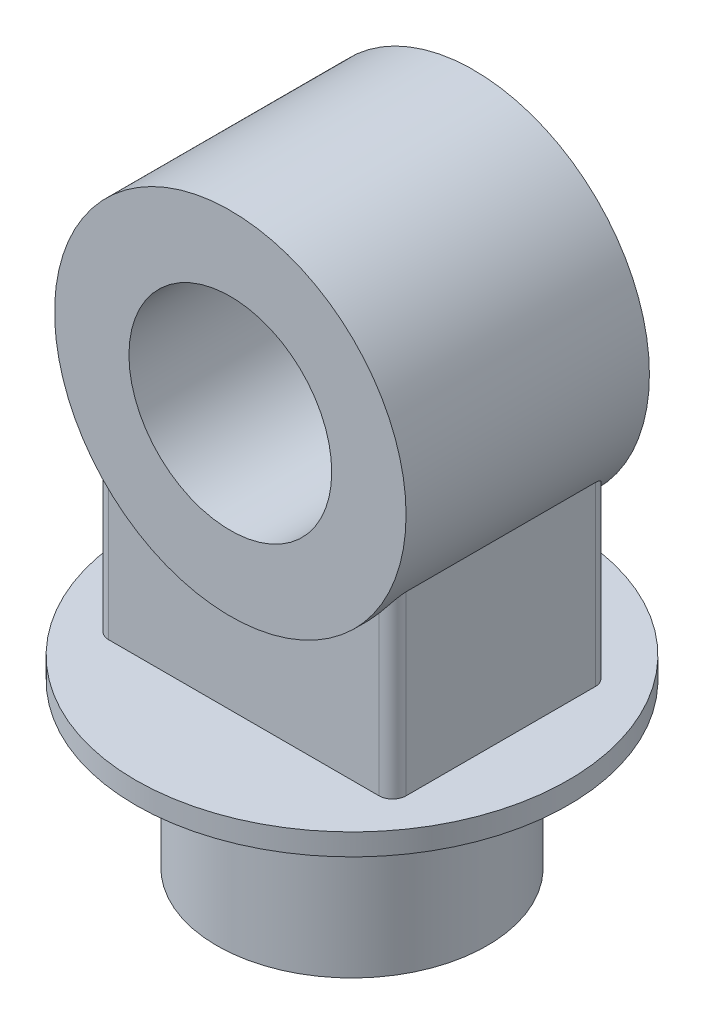
ISO-10303-21;
HEADER;
FILE_DESCRIPTION(('STEP AP214'),'2;1');
FILE_NAME('part.step','',(''),(''),'','','');
FILE_SCHEMA(('AUTOMOTIVE_DESIGN { 1 0 10303 214 1 1 1 1 }'));
ENDSEC;
DATA;
#1=APPLICATION_CONTEXT('core data for automotive mechanical design processes');
#2=APPLICATION_PROTOCOL_DEFINITION('international standard','automotive_design',2000,#1);
#3=PRODUCT_CONTEXT('',#1,'mechanical');
#4=PRODUCT('Part','Part','',(#3));
#5=PRODUCT_RELATED_PRODUCT_CATEGORY('part','',(#4));
#6=PRODUCT_DEFINITION_FORMATION('','',#4);
#7=PRODUCT_DEFINITION_CONTEXT('part definition',#1,'design');
#8=PRODUCT_DEFINITION('design','',#6,#7);
#9=PRODUCT_DEFINITION_SHAPE('','',#8);
#10=(LENGTH_UNIT() NAMED_UNIT(*) SI_UNIT(.MILLI.,.METRE.));
#11=(NAMED_UNIT(*) PLANE_ANGLE_UNIT() SI_UNIT($,.RADIAN.));
#12=(NAMED_UNIT(*) SI_UNIT($,.STERADIAN.) SOLID_ANGLE_UNIT());
#13=UNCERTAINTY_MEASURE_WITH_UNIT(LENGTH_MEASURE(1.E-05),#10,'distance_accuracy_value','');
#14=(GEOMETRIC_REPRESENTATION_CONTEXT(3) GLOBAL_UNCERTAINTY_ASSIGNED_CONTEXT((#13)) GLOBAL_UNIT_ASSIGNED_CONTEXT((#10,
#11,#12)) REPRESENTATION_CONTEXT('',''));
#15=CARTESIAN_POINT('',(0.,0.,0.));
#16=DIRECTION('',(0.,0.,1.));
#17=DIRECTION('',(1.,0.,0.));
#18=AXIS2_PLACEMENT_3D('',#15,#16,#17);
#19=CARTESIAN_POINT('',(0.,120.,0.));
#20=DIRECTION('',(0.,-1.,0.));
#21=DIRECTION('',(0.,0.,-1.));
#22=AXIS2_PLACEMENT_3D('',#19,#20,#21);
#23=CYLINDRICAL_SURFACE('',#22,100.);
#24=CARTESIAN_POINT('',(0.,120.,0.));
#25=DIRECTION('',(0.,1.,0.));
#26=DIRECTION('',(0.,0.,1.));
#27=AXIS2_PLACEMENT_3D('',#24,#25,#26);
#28=CIRCLE('',#27,100.);
#29=CARTESIAN_POINT('',(0.,120.,100.));
#30=VERTEX_POINT('',#29);
#31=EDGE_CURVE('E146',#30,#30,#28,.T.);
#32=ORIENTED_EDGE('',*,*,#31,.F.);
#33=EDGE_LOOP('',(#32));
#34=FACE_BOUND('',#33,.T.);
#35=CARTESIAN_POINT('',(0.,0.,0.));
#36=DIRECTION('',(0.,1.,0.));
#37=DIRECTION('',(0.,0.,1.));
#38=AXIS2_PLACEMENT_3D('',#35,#36,#37);
#39=CIRCLE('',#38,100.);
#40=CARTESIAN_POINT('',(0.,0.,100.));
#41=VERTEX_POINT('',#40);
#42=EDGE_CURVE('E229',#41,#41,#39,.T.);
#43=ORIENTED_EDGE('',*,*,#42,.T.);
#44=EDGE_LOOP('',(#43));
#45=FACE_BOUND('',#44,.T.);
#46=ADVANCED_FACE('F39',(#34,#45),#23,.T.);
#47=CARTESIAN_POINT('',(0.,0.,0.));
#48=DIRECTION('',(0.,1.,0.));
#49=DIRECTION('',(0.,0.,1.));
#50=AXIS2_PLACEMENT_3D('',#47,#48,#49);
#51=PLANE('',#50);
#52=ORIENTED_EDGE('',*,*,#42,.F.);
#53=EDGE_LOOP('',(#52));
#54=FACE_BOUND('',#53,.T.);
#55=ADVANCED_FACE('F242',(#54),#51,.F.);
#56=CARTESIAN_POINT('',(0.,136.,0.));
#57=DIRECTION('',(0.,-1.,0.));
#58=DIRECTION('',(0.,0.,-1.));
#59=AXIS2_PLACEMENT_3D('',#56,#57,#58);
#60=CYLINDRICAL_SURFACE('',#59,160.);
#61=CARTESIAN_POINT('',(0.,136.,0.));
#62=DIRECTION('',(0.,1.,0.));
#63=DIRECTION('',(0.,0.,1.));
#64=AXIS2_PLACEMENT_3D('',#61,#62,#63);
#65=CIRCLE('',#64,160.);
#66=CARTESIAN_POINT('',(0.,136.,160.));
#67=VERTEX_POINT('',#66);
#68=EDGE_CURVE('E225',#67,#67,#65,.T.);
#69=ORIENTED_EDGE('',*,*,#68,.F.);
#70=EDGE_LOOP('',(#69));
#71=FACE_BOUND('',#70,.T.);
#72=CARTESIAN_POINT('',(0.,120.,0.));
#73=DIRECTION('',(0.,1.,0.));
#74=DIRECTION('',(0.,0.,1.));
#75=AXIS2_PLACEMENT_3D('',#72,#73,#74);
#76=CIRCLE('',#75,160.);
#77=CARTESIAN_POINT('',(0.,120.,160.));
#78=VERTEX_POINT('',#77);
#79=EDGE_CURVE('E230',#78,#78,#76,.T.);
#80=ORIENTED_EDGE('',*,*,#79,.T.);
#81=EDGE_LOOP('',(#80));
#82=FACE_BOUND('',#81,.T.);
#83=ADVANCED_FACE('F244',(#71,#82),#60,.T.);
#84=CARTESIAN_POINT('',(0.,136.,0.));
#85=DIRECTION('',(0.,1.,0.));
#86=DIRECTION('',(0.,0.,1.));
#87=AXIS2_PLACEMENT_3D('',#84,#85,#86);
#88=PLANE('',#87);
#89=DIRECTION('',(0.,0.,-1.));
#90=VECTOR('',#89,1.);
#91=CARTESIAN_POINT('',(110.,136.,-80.));
#92=LINE('',#91,#90);
#93=CARTESIAN_POINT('',(110.,136.,70.));
#94=VERTEX_POINT('',#93);
#95=CARTESIAN_POINT('',(110.,136.,-70.));
#96=VERTEX_POINT('',#95);
#97=EDGE_CURVE('E234',#94,#96,#92,.T.);
#98=ORIENTED_EDGE('',*,*,#97,.F.);
#99=CARTESIAN_POINT('',(100.,136.,70.));
#100=DIRECTION('',(0.,1.,0.));
#101=DIRECTION('',(0.,0.,1.));
#102=AXIS2_PLACEMENT_3D('',#99,#100,#101);
#103=CIRCLE('',#102,10.);
#104=CARTESIAN_POINT('',(100.,136.,80.));
#105=VERTEX_POINT('',#104);
#106=EDGE_CURVE('E61',#94,#105,#103,.F.);
#107=ORIENTED_EDGE('',*,*,#106,.T.);
#108=DIRECTION('',(1.,0.,0.));
#109=VECTOR('',#108,1.);
#110=CARTESIAN_POINT('',(-110.,136.,80.));
#111=LINE('',#110,#109);
#112=CARTESIAN_POINT('',(-100.,136.,80.));
#113=VERTEX_POINT('',#112);
#114=EDGE_CURVE('E207',#113,#105,#111,.T.);
#115=ORIENTED_EDGE('',*,*,#114,.F.);
#116=CARTESIAN_POINT('',(-100.,136.,70.));
#117=DIRECTION('',(0.,1.,0.));
#118=DIRECTION('',(0.,0.,1.));
#119=AXIS2_PLACEMENT_3D('',#116,#117,#118);
#120=CIRCLE('',#119,10.);
#121=CARTESIAN_POINT('',(-110.,136.,70.));
#122=VERTEX_POINT('',#121);
#123=EDGE_CURVE('E54',#113,#122,#120,.F.);
#124=ORIENTED_EDGE('',*,*,#123,.T.);
#125=DIRECTION('',(0.,0.,1.));
#126=VECTOR('',#125,1.);
#127=CARTESIAN_POINT('',(-110.,136.,-80.));
#128=LINE('',#127,#126);
#129=CARTESIAN_POINT('',(-110.,136.,-70.));
#130=VERTEX_POINT('',#129);
#131=EDGE_CURVE('E206',#130,#122,#128,.T.);
#132=ORIENTED_EDGE('',*,*,#131,.F.);
#133=CARTESIAN_POINT('',(-100.,136.,-70.));
#134=DIRECTION('',(0.,1.,0.));
#135=DIRECTION('',(0.,0.,1.));
#136=AXIS2_PLACEMENT_3D('',#133,#134,#135);
#137=CIRCLE('',#136,10.);
#138=CARTESIAN_POINT('',(-100.,136.,-80.));
#139=VERTEX_POINT('',#138);
#140=EDGE_CURVE('E125',#130,#139,#137,.F.);
#141=ORIENTED_EDGE('',*,*,#140,.T.);
#142=DIRECTION('',(-1.,0.,0.));
#143=VECTOR('',#142,1.);
#144=CARTESIAN_POINT('',(-110.,136.,-80.));
#145=LINE('',#144,#143);
#146=CARTESIAN_POINT('',(100.,136.,-80.));
#147=VERTEX_POINT('',#146);
#148=EDGE_CURVE('E209',#147,#139,#145,.T.);
#149=ORIENTED_EDGE('',*,*,#148,.F.);
#150=CARTESIAN_POINT('',(100.,136.,-70.));
#151=DIRECTION('',(0.,1.,0.));
#152=DIRECTION('',(0.,0.,1.));
#153=AXIS2_PLACEMENT_3D('',#150,#151,#152);
#154=CIRCLE('',#153,10.);
#155=EDGE_CURVE('E124',#147,#96,#154,.F.);
#156=ORIENTED_EDGE('',*,*,#155,.T.);
#157=EDGE_LOOP('',(#98,#107,#115,#124,#132,#141,#149,#156));
#158=FACE_BOUND('',#157,.T.);
#159=ORIENTED_EDGE('',*,*,#68,.T.);
#160=EDGE_LOOP('',(#159));
#161=FACE_BOUND('',#160,.T.);
#162=ADVANCED_FACE('F204',(#158,#161),#88,.T.);
#163=CARTESIAN_POINT('',(0.,120.,0.));
#164=DIRECTION('',(0.,1.,0.));
#165=DIRECTION('',(0.,0.,1.));
#166=AXIS2_PLACEMENT_3D('',#163,#164,#165);
#167=PLANE('',#166);
#168=ORIENTED_EDGE('',*,*,#31,.T.);
#169=EDGE_LOOP('',(#168));
#170=FACE_BOUND('',#169,.T.);
#171=ORIENTED_EDGE('',*,*,#79,.F.);
#172=EDGE_LOOP('',(#171));
#173=FACE_BOUND('',#172,.T.);
#174=ADVANCED_FACE('F253',(#170,#173),#167,.F.);
#175=CARTESIAN_POINT('',(-110.,466.002,-80.));
#176=DIRECTION('',(0.,0.,1.));
#177=DIRECTION('',(1.,0.,0.));
#178=AXIS2_PLACEMENT_3D('',#175,#176,#177);
#179=PLANE('',#178);
#180=ORIENTED_EDGE('',*,*,#148,.T.);
#181=DIRECTION('',(0.,-1.,0.));
#182=VECTOR('',#181,1.);
#183=CARTESIAN_POINT('',(-100.,466.002,-80.));
#184=LINE('',#183,#182);
#185=CARTESIAN_POINT('',(-100.,252.933761370819,-80.));
#186=VERTEX_POINT('',#185);
#187=EDGE_CURVE('E144',#139,#186,#184,.F.);
#188=ORIENTED_EDGE('',*,*,#187,.T.);
#189=CARTESIAN_POINT('',(0.,336.,-80.));
#190=DIRECTION('',(0.,0.,1.));
#191=DIRECTION('',(1.,0.,0.));
#192=AXIS2_PLACEMENT_3D('',#189,#190,#191);
#193=CIRCLE('',#192,130.);
#194=CARTESIAN_POINT('',(100.,252.933761370819,-80.));
#195=VERTEX_POINT('',#194);
#196=EDGE_CURVE('E119',#195,#186,#193,.F.);
#197=ORIENTED_EDGE('',*,*,#196,.F.);
#198=DIRECTION('',(0.,-1.,0.));
#199=VECTOR('',#198,1.);
#200=CARTESIAN_POINT('',(100.,466.002,-80.));
#201=LINE('',#200,#199);
#202=EDGE_CURVE('E139',#195,#147,#201,.T.);
#203=ORIENTED_EDGE('',*,*,#202,.T.);
#204=EDGE_LOOP('',(#180,#188,#197,#203));
#205=FACE_BOUND('',#204,.T.);
#206=ADVANCED_FACE('F256',(#205),#179,.F.);
#207=CARTESIAN_POINT('',(110.,466.002,-80.));
#208=DIRECTION('',(-1.,0.,0.));
#209=DIRECTION('',(0.,0.,1.));
#210=AXIS2_PLACEMENT_3D('',#207,#208,#209);
#211=PLANE('',#210);
#212=ORIENTED_EDGE('',*,*,#97,.T.);
#213=DIRECTION('',(0.,-1.,0.));
#214=VECTOR('',#213,1.);
#215=CARTESIAN_POINT('',(110.,466.002,-70.));
#216=LINE('',#215,#214);
#217=CARTESIAN_POINT('',(110.,266.717967697245,-70.));
#218=VERTEX_POINT('',#217);
#219=EDGE_CURVE('E156',#96,#218,#216,.F.);
#220=ORIENTED_EDGE('',*,*,#219,.T.);
#221=DIRECTION('',(0.,0.,-1.));
#222=VECTOR('',#221,1.);
#223=CARTESIAN_POINT('',(110.,266.717967697245,90.));
#224=LINE('',#223,#222);
#225=CARTESIAN_POINT('',(110.,266.717967697245,70.));
#226=VERTEX_POINT('',#225);
#227=EDGE_CURVE('E275',#226,#218,#224,.T.);
#228=ORIENTED_EDGE('',*,*,#227,.F.);
#229=DIRECTION('',(0.,-1.,0.));
#230=VECTOR('',#229,1.);
#231=CARTESIAN_POINT('',(110.,466.002,70.));
#232=LINE('',#231,#230);
#233=EDGE_CURVE('E152',#226,#94,#232,.T.);
#234=ORIENTED_EDGE('',*,*,#233,.T.);
#235=EDGE_LOOP('',(#212,#220,#228,#234));
#236=FACE_BOUND('',#235,.T.);
#237=ADVANCED_FACE('F264',(#236),#211,.F.);
#238=CARTESIAN_POINT('',(-110.,466.002,-80.));
#239=DIRECTION('',(1.,0.,0.));
#240=DIRECTION('',(0.,0.,-1.));
#241=AXIS2_PLACEMENT_3D('',#238,#239,#240);
#242=PLANE('',#241);
#243=DIRECTION('',(0.,0.,-1.));
#244=VECTOR('',#243,1.);
#245=CARTESIAN_POINT('',(-110.,266.717967697245,90.));
#246=LINE('',#245,#244);
#247=CARTESIAN_POINT('',(-110.,266.717967697245,-70.));
#248=VERTEX_POINT('',#247);
#249=CARTESIAN_POINT('',(-110.,266.717967697245,70.));
#250=VERTEX_POINT('',#249);
#251=EDGE_CURVE('E116',#248,#250,#246,.F.);
#252=ORIENTED_EDGE('',*,*,#251,.F.);
#253=DIRECTION('',(0.,-1.,0.));
#254=VECTOR('',#253,1.);
#255=CARTESIAN_POINT('',(-110.,466.002,-70.));
#256=LINE('',#255,#254);
#257=EDGE_CURVE('E131',#248,#130,#256,.T.);
#258=ORIENTED_EDGE('',*,*,#257,.T.);
#259=ORIENTED_EDGE('',*,*,#131,.T.);
#260=DIRECTION('',(0.,-1.,0.));
#261=VECTOR('',#260,1.);
#262=CARTESIAN_POINT('',(-110.,466.002,70.));
#263=LINE('',#262,#261);
#264=EDGE_CURVE('E133',#122,#250,#263,.F.);
#265=ORIENTED_EDGE('',*,*,#264,.T.);
#266=EDGE_LOOP('',(#252,#258,#259,#265));
#267=FACE_BOUND('',#266,.T.);
#268=ADVANCED_FACE('F129',(#267),#242,.F.);
#269=CARTESIAN_POINT('',(-110.,466.002,80.));
#270=DIRECTION('',(0.,0.,-1.));
#271=DIRECTION('',(-1.,0.,0.));
#272=AXIS2_PLACEMENT_3D('',#269,#270,#271);
#273=PLANE('',#272);
#274=ORIENTED_EDGE('',*,*,#114,.T.);
#275=DIRECTION('',(0.,-1.,0.));
#276=VECTOR('',#275,1.);
#277=CARTESIAN_POINT('',(100.,466.002,80.));
#278=LINE('',#277,#276);
#279=CARTESIAN_POINT('',(100.,252.933761370819,80.));
#280=VERTEX_POINT('',#279);
#281=EDGE_CURVE('E162',#105,#280,#278,.F.);
#282=ORIENTED_EDGE('',*,*,#281,.T.);
#283=CARTESIAN_POINT('',(0.,336.,80.));
#284=DIRECTION('',(0.,0.,-1.));
#285=DIRECTION('',(-1.,0.,0.));
#286=AXIS2_PLACEMENT_3D('',#283,#284,#285);
#287=CIRCLE('',#286,130.);
#288=CARTESIAN_POINT('',(-100.,252.933761370819,80.));
#289=VERTEX_POINT('',#288);
#290=EDGE_CURVE('E135',#289,#280,#287,.F.);
#291=ORIENTED_EDGE('',*,*,#290,.F.);
#292=DIRECTION('',(0.,-1.,0.));
#293=VECTOR('',#292,1.);
#294=CARTESIAN_POINT('',(-100.,466.002,80.));
#295=LINE('',#294,#293);
#296=EDGE_CURVE('E159',#289,#113,#295,.T.);
#297=ORIENTED_EDGE('',*,*,#296,.T.);
#298=EDGE_LOOP('',(#274,#282,#291,#297));
#299=FACE_BOUND('',#298,.T.);
#300=ADVANCED_FACE('F214',(#299),#273,.F.);
#301=CARTESIAN_POINT('',(0.,336.,90.));
#302=DIRECTION('',(0.,0.,-1.));
#303=DIRECTION('',(-1.,0.,0.));
#304=AXIS2_PLACEMENT_3D('',#301,#302,#303);
#305=CYLINDRICAL_SURFACE('',#304,130.);
#306=CARTESIAN_POINT('',(0.,336.,90.));
#307=DIRECTION('',(0.,0.,1.));
#308=DIRECTION('',(1.,0.,0.));
#309=AXIS2_PLACEMENT_3D('',#306,#307,#308);
#310=CIRCLE('',#309,130.);
#311=CARTESIAN_POINT('',(130.,336.,90.));
#312=VERTEX_POINT('',#311);
#313=EDGE_CURVE('E217',#312,#312,#310,.T.);
#314=ORIENTED_EDGE('',*,*,#313,.F.);
#315=EDGE_LOOP('',(#314));
#316=FACE_BOUND('',#315,.T.);
#317=CARTESIAN_POINT('',(0.,336.,-90.));
#318=DIRECTION('',(0.,0.,1.));
#319=DIRECTION('',(1.,0.,0.));
#320=AXIS2_PLACEMENT_3D('',#317,#318,#319);
#321=CIRCLE('',#320,130.);
#322=CARTESIAN_POINT('',(130.,336.,-90.));
#323=VERTEX_POINT('',#322);
#324=EDGE_CURVE('E221',#323,#323,#321,.T.);
#325=ORIENTED_EDGE('',*,*,#324,.T.);
#326=EDGE_LOOP('',(#325));
#327=FACE_BOUND('',#326,.T.);
#328=ORIENTED_EDGE('',*,*,#290,.T.);
#329=CARTESIAN_POINT('',(100.,252.933761370819,80.));
#330=CARTESIAN_POINT('',(100.223611151915,253.202952503255,79.9999830665315));
#331=CARTESIAN_POINT('',(100.446118360057,253.473036166024,79.9924995885085));
#332=CARTESIAN_POINT('',(100.888548742496,254.014496760122,79.9629173131463));
#333=CARTESIAN_POINT('',(101.108472043759,254.285873626978,79.9408192370116));
#334=CARTESIAN_POINT('',(101.545586290072,254.829711400373,79.8822979337703));
#335=CARTESIAN_POINT('',(101.76277446753,255.102173087004,79.8458612385231));
#336=CARTESIAN_POINT('',(102.193849033468,255.647413797012,79.7588609087488));
#337=CARTESIAN_POINT('',(102.407735374993,255.920192824843,79.7082970735217));
#338=CARTESIAN_POINT('',(103.048408055095,256.74400885936,79.5343891784366));
#339=CARTESIAN_POINT('',(103.469748368072,257.294974230618,79.3894263280958));
#340=CARTESIAN_POINT('',(104.088382224678,258.117224843771,79.1288060997197));
#341=CARTESIAN_POINT('',(104.292337034927,258.39057162742,79.0347525474724));
#342=CARTESIAN_POINT('',(104.695498702643,258.935304765081,78.8319429710982));
#343=CARTESIAN_POINT('',(104.894706004332,259.206691300842,78.7231883289499));
#344=CARTESIAN_POINT('',(105.336170271764,259.812965668139,78.4620472638272));
#345=CARTESIAN_POINT('',(105.577006541077,260.147108038148,78.3055009036513));
#346=CARTESIAN_POINT('',(106.04966094987,260.809343252621,77.967808626391));
#347=CARTESIAN_POINT('',(106.281479043935,261.137436066616,77.7866625854444));
#348=CARTESIAN_POINT('',(106.734152264033,261.784259610706,77.3986376161628));
#349=CARTESIAN_POINT('',(106.955036134368,262.103013877598,77.1918317878757));
#350=CARTESIAN_POINT('',(107.384708325122,262.728803605627,76.749894392022));
#351=CARTESIAN_POINT('',(107.593501627276,263.035843875289,76.5147746155492));
#352=CARTESIAN_POINT('',(107.921279015409,263.522080966666,76.1068757916446));
#353=CARTESIAN_POINT('',(108.044709884718,263.706240813682,75.9435605188263));
#354=CARTESIAN_POINT('',(108.284949666933,264.066582834907,75.6038296157538));
#355=CARTESIAN_POINT('',(108.401760304956,264.242767084986,75.4274174262629));
#356=CARTESIAN_POINT('',(108.627683741988,264.585236991633,75.0605773993746));
#357=CARTESIAN_POINT('',(108.736797961361,264.751524473746,74.8701521613913));
#358=CARTESIAN_POINT('',(108.945874410432,265.071634412635,74.4745306992528));
#359=CARTESIAN_POINT('',(109.04583974995,265.225461102935,74.2693395369045));
#360=CARTESIAN_POINT('',(109.274660386151,265.579056080623,73.7536743100227));
#361=CARTESIAN_POINT('',(109.398046362816,265.771031349643,73.4351396850742));
#362=CARTESIAN_POINT('',(109.561336457207,266.026263049992,72.9345418523036));
#363=CARTESIAN_POINT('',(109.612072269395,266.105785634321,72.7641622498837));
#364=CARTESIAN_POINT('',(109.705421847597,266.25239837099,72.4160328323223));
#365=CARTESIAN_POINT('',(109.748040656091,266.319496241142,72.2382876769633));
#366=CARTESIAN_POINT('',(109.820262744001,266.433384610412,71.8947331689276));
#367=CARTESIAN_POINT('',(109.850752312767,266.481551609067,71.729567610939));
#368=CARTESIAN_POINT('',(109.903691363628,266.565274678988,71.3948451418076));
#369=CARTESIAN_POINT('',(109.926143541964,266.600834979285,71.2252897238033));
#370=CARTESIAN_POINT('',(109.962659042777,266.658707696818,70.8807814271977));
#371=CARTESIAN_POINT('',(109.976613864032,266.680848750137,70.7057875562757));
#372=CARTESIAN_POINT('',(109.99061964662,266.703076138542,70.4419386674803));
#373=CARTESIAN_POINT('',(109.99413386492,266.708654625171,70.3536902139711));
#374=CARTESIAN_POINT('',(109.998824989492,266.716102079046,70.1769662160102));
#375=CARTESIAN_POINT('',(110.000001659485,266.717970671296,70.088490649507));
#376=CARTESIAN_POINT('',(110.,266.717967697245,70.));
#377=B_SPLINE_CURVE_WITH_KNOTS('',3,(#329,#330,#331,#332,#333,#334,#335,#336,#337,#338,#339,
#340,#341,#342,#343,#344,#345,#346,#347,#348,#349,#350,#351,#352,#353,#354,#355,#356,#357,#358,
#359,#360,#361,#362,#363,#364,#365,#366,#367,#368,#369,#370,#371,#372,#373,#374,#375,#376),
.UNSPECIFIED.,.F.,.F.,(4,2,2,2,2,2,2,2,2,2,2,2,2,2,2,2,2,2,2,2,2,2,2,4),(0.,1.04974156507782,
2.09943133114573,3.15010942417265,4.20080244462031,6.3235627893386,7.38465211465333,
8.44564176134499,9.76677685539395,11.087918601761,12.4053795382948,13.7222937149077,
14.5479419827464,15.3733741023698,16.1986534888326,17.023651302289,18.194686650492,
18.7783719827905,19.3616935243415,19.8852298594992,20.4085904030381,20.9385006934629,
21.2038887699913,21.4693036704869),.UNSPECIFIED.);
#378=EDGE_CURVE('E197',#280,#226,#377,.T.);
#379=ORIENTED_EDGE('',*,*,#378,.T.);
#380=ORIENTED_EDGE('',*,*,#227,.T.);
#381=CARTESIAN_POINT('',(110.,266.717967697245,-70.));
#382=CARTESIAN_POINT('',(110.000033683462,266.718025852698,-70.1614230595313));
#383=CARTESIAN_POINT('',(109.996092792414,266.711764254296,-70.3228118197691));
#384=CARTESIAN_POINT('',(109.980519982779,266.687045880384,-70.6441123999958));
#385=CARTESIAN_POINT('',(109.968896213713,266.668602027069,-70.8040256031146));
#386=CARTESIAN_POINT('',(109.938376398954,266.620217986395,-71.1196424551221));
#387=CARTESIAN_POINT('',(109.919558261622,266.590400967593,-71.2753727040436));
#388=CARTESIAN_POINT('',(109.875071558334,266.52000006118,-71.5834085562726));
#389=CARTESIAN_POINT('',(109.849400846184,266.479412800404,-71.7357130704249));
#390=CARTESIAN_POINT('',(109.784772267017,266.377386983169,-72.0722520040974));
#391=CARTESIAN_POINT('',(109.744103525393,266.313281105856,-72.2553511890568));
#392=CARTESIAN_POINT('',(109.654040532803,266.17165023193,-72.6141464391851));
#393=CARTESIAN_POINT('',(109.604640075501,266.094115691273,-72.7898371277865));
#394=CARTESIAN_POINT('',(109.497968805892,265.927147418338,-73.1338723913451));
#395=CARTESIAN_POINT('',(109.440667457039,265.837667562915,-73.3021849515411));
#396=CARTESIAN_POINT('',(109.319341126161,265.648779195145,-73.6304969218559));
#397=CARTESIAN_POINT('',(109.25531768694,265.549372961282,-73.7904982269664));
#398=CARTESIAN_POINT('',(109.085069343255,265.28590129292,-74.1868876463209));
#399=CARTESIAN_POINT('',(108.974781990569,265.115997241409,-74.4176642111939));
#400=CARTESIAN_POINT('',(108.742772943656,264.76058359918,-74.8607110351426));
#401=CARTESIAN_POINT('',(108.621044869784,264.575065307649,-75.072970840064));
#402=CARTESIAN_POINT('',(108.36794946479,264.19164129378,-75.4804206329535));
#403=CARTESIAN_POINT('',(108.236568322626,263.993717884812,-75.6755852518652));
#404=CARTESIAN_POINT('',(107.965814499919,263.588382733387,-76.0497203250662));
#405=CARTESIAN_POINT('',(107.826442440892,263.380971729107,-76.2286920360201));
#406=CARTESIAN_POINT('',(107.56145650763,262.989174407744,-76.5468161797372));
#407=CARTESIAN_POINT('',(107.436764821801,262.805791987749,-76.6879854690674));
#408=CARTESIAN_POINT('',(107.182869679799,262.434497987953,-76.9599552926784));
#409=CARTESIAN_POINT('',(107.053665586411,262.24658576965,-77.0907543539386));
#410=CARTESIAN_POINT('',(106.659844344167,261.677121003612,-77.4685356621902));
#411=CARTESIAN_POINT('',(106.389102445143,261.289965080353,-77.7008024816961));
#412=CARTESIAN_POINT('',(105.833418194947,260.504836154638,-78.129863631631));
#413=CARTESIAN_POINT('',(105.548442441802,260.106838810795,-78.3265689888296));
#414=CARTESIAN_POINT('',(104.96676628824,259.304344779382,-78.6860846955172));
#415=CARTESIAN_POINT('',(104.670068038633,258.899849292081,-78.8489012287858));
#416=CARTESIAN_POINT('',(104.024574509401,258.030646711215,-79.1623550419402));
#417=CARTESIAN_POINT('',(103.674248758637,257.565348460988,-79.3081944572229));
#418=CARTESIAN_POINT('',(102.961876677953,256.632523338709,-79.558756520093));
#419=CARTESIAN_POINT('',(102.599828734006,256.16499616738,-79.6634734792563));
#420=CARTESIAN_POINT('',(102.051092736822,255.466397204689,-79.7891645729388));
#421=CARTESIAN_POINT('',(101.868137468165,255.235094848973,-79.8257282191265));
#422=CARTESIAN_POINT('',(101.499966150616,254.77288550036,-79.8886289353229));
#423=CARTESIAN_POINT('',(101.314750133026,254.541978502041,-79.9149661467555));
#424=CARTESIAN_POINT('',(100.942320486513,254.080919722901,-79.9572665465168));
#425=CARTESIAN_POINT('',(100.755107350153,253.850767773367,-79.9732322353467));
#426=CARTESIAN_POINT('',(100.378860262163,253.391449185777,-79.9945948234744));
#427=CARTESIAN_POINT('',(100.189826234412,253.162282589497,-79.9999912789888));
#428=CARTESIAN_POINT('',(100.,252.933761370819,-80.));
#429=B_SPLINE_CURVE_WITH_KNOTS('',3,(#381,#382,#383,#384,#385,#386,#387,#388,#389,#390,#391,
#392,#393,#394,#395,#396,#397,#398,#399,#400,#401,#402,#403,#404,#405,#406,#407,#408,#409,#410,
#411,#412,#413,#414,#415,#416,#417,#418,#419,#420,#421,#422,#423,#424,#425,#426,#427,#428),
.UNSPECIFIED.,.F.,.F.,(4,2,2,2,2,2,2,2,2,2,2,2,2,2,2,2,2,2,2,2,2,2,2,4),(0.,0.484045005923083,
0.967577389145412,1.44601544684507,1.92460352520314,2.51835043890468,3.11252108624076,
3.70905613988741,4.30545457926273,5.22516595363372,6.14539326092329,7.06696382284195,
7.98846280401965,8.77680092000544,9.56525081419898,11.1426900482287,12.7240229357798,
14.305067020047,16.1047501551828,17.9046821508917,18.7960435003637,19.6873925225409,
20.5785265668948,21.4696980275819),.UNSPECIFIED.);
#430=EDGE_CURVE('E188',#218,#195,#429,.T.);
#431=ORIENTED_EDGE('',*,*,#430,.T.);
#432=ORIENTED_EDGE('',*,*,#196,.T.);
#433=CARTESIAN_POINT('',(-100.,252.933761370819,-80.));
#434=CARTESIAN_POINT('',(-100.223611151915,253.202952503255,-79.9999830665315));
#435=CARTESIAN_POINT('',(-100.446118360057,253.473036166024,-79.9924995885085));
#436=CARTESIAN_POINT('',(-100.888548742496,254.014496760122,-79.9629173131463));
#437=CARTESIAN_POINT('',(-101.108472043759,254.285873626978,-79.9408192370116));
#438=CARTESIAN_POINT('',(-101.545586290072,254.829711400373,-79.8822979337703));
#439=CARTESIAN_POINT('',(-101.76277446753,255.102173087004,-79.8458612385231));
#440=CARTESIAN_POINT('',(-102.193849033468,255.647413797012,-79.7588609087488));
#441=CARTESIAN_POINT('',(-102.407735374993,255.920192824843,-79.7082970735217));
#442=CARTESIAN_POINT('',(-103.048408055095,256.74400885936,-79.5343891784366));
#443=CARTESIAN_POINT('',(-103.469748368072,257.294974230618,-79.3894263280958));
#444=CARTESIAN_POINT('',(-104.088382224678,258.117224843771,-79.1288060997198));
#445=CARTESIAN_POINT('',(-104.292337034927,258.39057162742,-79.0347525474725));
#446=CARTESIAN_POINT('',(-104.695498702643,258.935304765081,-78.8319429710982));
#447=CARTESIAN_POINT('',(-104.894706004332,259.206691300842,-78.7231883289499));
#448=CARTESIAN_POINT('',(-105.336170271764,259.812965668139,-78.4620472638272));
#449=CARTESIAN_POINT('',(-105.577006541077,260.147108038148,-78.3055009036513));
#450=CARTESIAN_POINT('',(-106.04966094987,260.809343252621,-77.967808626391));
#451=CARTESIAN_POINT('',(-106.281479043935,261.137436066616,-77.7866625854444));
#452=CARTESIAN_POINT('',(-106.734152264033,261.784259610706,-77.3986376161629));
#453=CARTESIAN_POINT('',(-106.955036134368,262.103013877599,-77.1918317878758));
#454=CARTESIAN_POINT('',(-107.384708325122,262.728803605627,-76.7498943920221));
#455=CARTESIAN_POINT('',(-107.593501627276,263.035843875289,-76.5147746155493));
#456=CARTESIAN_POINT('',(-107.921279015409,263.522080966666,-76.1068757916446));
#457=CARTESIAN_POINT('',(-108.044709884718,263.706240813682,-75.9435605188263));
#458=CARTESIAN_POINT('',(-108.284949666933,264.066582834907,-75.6038296157539));
#459=CARTESIAN_POINT('',(-108.401760304956,264.242767084986,-75.4274174262629));
#460=CARTESIAN_POINT('',(-108.627683741988,264.585236991633,-75.0605773993747));
#461=CARTESIAN_POINT('',(-108.736797961361,264.751524473746,-74.8701521613913));
#462=CARTESIAN_POINT('',(-108.945874410432,265.071634412635,-74.4745306992528));
#463=CARTESIAN_POINT('',(-109.04583974995,265.225461102935,-74.2693395369045));
#464=CARTESIAN_POINT('',(-109.274660386151,265.579056080623,-73.7536743100228));
#465=CARTESIAN_POINT('',(-109.398046362816,265.771031349643,-73.4351396850743));
#466=CARTESIAN_POINT('',(-109.561336457207,266.026263049992,-72.9345418523036));
#467=CARTESIAN_POINT('',(-109.612072269395,266.105785634321,-72.7641622498837));
#468=CARTESIAN_POINT('',(-109.705421847597,266.25239837099,-72.4160328323223));
#469=CARTESIAN_POINT('',(-109.748040656091,266.319496241142,-72.2382876769633));
#470=CARTESIAN_POINT('',(-109.820262744001,266.433384610412,-71.8947331689277));
#471=CARTESIAN_POINT('',(-109.850752312767,266.481551609067,-71.7295676109391));
#472=CARTESIAN_POINT('',(-109.903691363628,266.565274678988,-71.3948451418077));
#473=CARTESIAN_POINT('',(-109.926143541964,266.600834979285,-71.2252897238034));
#474=CARTESIAN_POINT('',(-109.962659042777,266.658707696818,-70.8807814271978));
#475=CARTESIAN_POINT('',(-109.976613864032,266.680848750137,-70.7057875562757));
#476=CARTESIAN_POINT('',(-109.99061964662,266.703076138542,-70.4419386674803));
#477=CARTESIAN_POINT('',(-109.99413386492,266.708654625171,-70.3536902139711));
#478=CARTESIAN_POINT('',(-109.998824989492,266.716102079046,-70.1769662160102));
#479=CARTESIAN_POINT('',(-110.000001659485,266.717970671296,-70.0884906495071));
#480=CARTESIAN_POINT('',(-110.,266.717967697245,-70.));
#481=B_SPLINE_CURVE_WITH_KNOTS('',3,(#433,#434,#435,#436,#437,#438,#439,#440,#441,#442,#443,
#444,#445,#446,#447,#448,#449,#450,#451,#452,#453,#454,#455,#456,#457,#458,#459,#460,#461,#462,
#463,#464,#465,#466,#467,#468,#469,#470,#471,#472,#473,#474,#475,#476,#477,#478,#479,#480),
.UNSPECIFIED.,.F.,.F.,(4,2,2,2,2,2,2,2,2,2,2,2,2,2,2,2,2,2,2,2,2,2,2,4),(0.,1.04974156507777,
2.09943133114568,3.1501094241726,4.20080244462026,6.32356278933854,7.38465211465329,
8.44564176134495,9.76677685539391,11.0879186017609,12.4053795382948,13.7222937149076,
14.5479419827463,15.3733741023697,16.1986534888326,17.0236513022889,18.1946866504919,
18.7783719827904,19.3616935243414,19.8852298594992,20.408590403038,20.9385006934629,
21.2038887699912,21.4693036704869),.UNSPECIFIED.);
#482=EDGE_CURVE('E112',#186,#248,#481,.T.);
#483=ORIENTED_EDGE('',*,*,#482,.T.);
#484=ORIENTED_EDGE('',*,*,#251,.T.);
#485=CARTESIAN_POINT('',(-110.,266.717967697245,70.));
#486=CARTESIAN_POINT('',(-110.000033683462,266.718025852698,70.1614230595313));
#487=CARTESIAN_POINT('',(-109.996092792414,266.711764254296,70.3228118197691));
#488=CARTESIAN_POINT('',(-109.980519982779,266.687045880384,70.6441123999957));
#489=CARTESIAN_POINT('',(-109.968896213713,266.668602027069,70.8040256031146));
#490=CARTESIAN_POINT('',(-109.938376398954,266.620217986395,71.1196424551221));
#491=CARTESIAN_POINT('',(-109.919558261622,266.590400967593,71.2753727040436));
#492=CARTESIAN_POINT('',(-109.875071558334,266.52000006118,71.5834085562726));
#493=CARTESIAN_POINT('',(-109.849400846184,266.479412800404,71.7357130704249));
#494=CARTESIAN_POINT('',(-109.784772267017,266.377386983169,72.0722520040974));
#495=CARTESIAN_POINT('',(-109.744103525393,266.313281105856,72.2553511890568));
#496=CARTESIAN_POINT('',(-109.654040532803,266.17165023193,72.6141464391851));
#497=CARTESIAN_POINT('',(-109.604640075501,266.094115691273,72.7898371277865));
#498=CARTESIAN_POINT('',(-109.497968805892,265.927147418338,73.133872391345));
#499=CARTESIAN_POINT('',(-109.440667457039,265.837667562915,73.302184951541));
#500=CARTESIAN_POINT('',(-109.319341126161,265.648779195145,73.6304969218558));
#501=CARTESIAN_POINT('',(-109.25531768694,265.549372961282,73.7904982269664));
#502=CARTESIAN_POINT('',(-109.085069343255,265.28590129292,74.1868876463209));
#503=CARTESIAN_POINT('',(-108.974781990569,265.115997241409,74.4176642111939));
#504=CARTESIAN_POINT('',(-108.742772943656,264.76058359918,74.8607110351426));
#505=CARTESIAN_POINT('',(-108.621044869784,264.575065307649,75.072970840064));
#506=CARTESIAN_POINT('',(-108.36794946479,264.19164129378,75.4804206329535));
#507=CARTESIAN_POINT('',(-108.236568322626,263.993717884812,75.6755852518652));
#508=CARTESIAN_POINT('',(-107.965814499919,263.588382733387,76.0497203250661));
#509=CARTESIAN_POINT('',(-107.826442440892,263.380971729107,76.2286920360201));
#510=CARTESIAN_POINT('',(-107.56145650763,262.989174407744,76.5468161797372));
#511=CARTESIAN_POINT('',(-107.436764821801,262.805791987749,76.6879854690673));
#512=CARTESIAN_POINT('',(-107.182869679799,262.434497987953,76.9599552926783));
#513=CARTESIAN_POINT('',(-107.053665586411,262.24658576965,77.0907543539386));
#514=CARTESIAN_POINT('',(-106.659844344167,261.677121003612,77.4685356621902));
#515=CARTESIAN_POINT('',(-106.389102445143,261.289965080353,77.7008024816961));
#516=CARTESIAN_POINT('',(-105.833418194947,260.504836154638,78.129863631631));
#517=CARTESIAN_POINT('',(-105.548442441802,260.106838810795,78.3265689888296));
#518=CARTESIAN_POINT('',(-104.96676628824,259.304344779382,78.6860846955171));
#519=CARTESIAN_POINT('',(-104.670068038633,258.899849292081,78.8489012287858));
#520=CARTESIAN_POINT('',(-104.024574509401,258.030646711215,79.1623550419402));
#521=CARTESIAN_POINT('',(-103.674248758637,257.565348460988,79.3081944572228));
#522=CARTESIAN_POINT('',(-102.961876677953,256.632523338709,79.558756520093));
#523=CARTESIAN_POINT('',(-102.599828734006,256.16499616738,79.6634734792563));
#524=CARTESIAN_POINT('',(-102.051092736822,255.466397204689,79.7891645729387));
#525=CARTESIAN_POINT('',(-101.868137468165,255.235094848973,79.8257282191264));
#526=CARTESIAN_POINT('',(-101.499966150616,254.77288550036,79.8886289353229));
#527=CARTESIAN_POINT('',(-101.314750133026,254.541978502041,79.9149661467555));
#528=CARTESIAN_POINT('',(-100.942320486513,254.080919722901,79.9572665465167));
#529=CARTESIAN_POINT('',(-100.755107350153,253.850767773367,79.9732322353467));
#530=CARTESIAN_POINT('',(-100.378860262163,253.391449185777,79.9945948234744));
#531=CARTESIAN_POINT('',(-100.189826234412,253.162282589497,79.9999912789887));
#532=CARTESIAN_POINT('',(-100.,252.933761370819,80.));
#533=B_SPLINE_CURVE_WITH_KNOTS('',3,(#485,#486,#487,#488,#489,#490,#491,#492,#493,#494,#495,
#496,#497,#498,#499,#500,#501,#502,#503,#504,#505,#506,#507,#508,#509,#510,#511,#512,#513,#514,
#515,#516,#517,#518,#519,#520,#521,#522,#523,#524,#525,#526,#527,#528,#529,#530,#531,#532),
.UNSPECIFIED.,.F.,.F.,(4,2,2,2,2,2,2,2,2,2,2,2,2,2,2,2,2,2,2,2,2,2,2,4),(0.,0.484045005923084,
0.967577389145426,1.44601544684507,1.92460352520314,2.51835043890468,3.11252108624077,
3.70905613988742,4.30545457926274,5.22516595363374,6.14539326092328,7.06696382284191,
7.98846280401964,8.77680092000539,9.56525081419896,11.1426900482287,12.7240229357798,
14.305067020047,16.1047501551828,17.9046821508917,18.7960435003637,19.6873925225409,
20.5785265668947,21.4696980275819),.UNSPECIFIED.);
#534=EDGE_CURVE('E11',#250,#289,#533,.T.);
#535=ORIENTED_EDGE('',*,*,#534,.T.);
#536=EDGE_LOOP('',(#328,#379,#380,#431,#432,#483,#484,#535));
#537=FACE_BOUND('',#536,.T.);
#538=ADVANCED_FACE('F115',(#316,#327,#537),#305,.T.);
#539=CARTESIAN_POINT('',(0.,336.,90.));
#540=DIRECTION('',(0.,0.,1.));
#541=DIRECTION('',(1.,0.,0.));
#542=AXIS2_PLACEMENT_3D('',#539,#540,#541);
#543=PLANE('',#542);
#544=ORIENTED_EDGE('',*,*,#313,.T.);
#545=EDGE_LOOP('',(#544));
#546=FACE_BOUND('',#545,.T.);
#547=CARTESIAN_POINT('',(0.,336.,90.));
#548=DIRECTION('',(0.,0.,1.));
#549=DIRECTION('',(1.,0.,0.));
#550=AXIS2_PLACEMENT_3D('',#547,#548,#549);
#551=CIRCLE('',#550,75.);
#552=CARTESIAN_POINT('',(-75.,336.,90.));
#553=VERTEX_POINT('',#552);
#554=EDGE_CURVE('E408',#553,#553,#551,.T.);
#555=ORIENTED_EDGE('',*,*,#554,.F.);
#556=EDGE_LOOP('',(#555));
#557=FACE_BOUND('',#556,.T.);
#558=ADVANCED_FACE('F325',(#546,#557),#543,.T.);
#559=CARTESIAN_POINT('',(0.,336.,-90.));
#560=DIRECTION('',(0.,0.,1.));
#561=DIRECTION('',(1.,0.,0.));
#562=AXIS2_PLACEMENT_3D('',#559,#560,#561);
#563=PLANE('',#562);
#564=ORIENTED_EDGE('',*,*,#324,.F.);
#565=EDGE_LOOP('',(#564));
#566=FACE_BOUND('',#565,.T.);
#567=CARTESIAN_POINT('',(0.,336.,-90.));
#568=DIRECTION('',(0.,0.,1.));
#569=DIRECTION('',(1.,0.,0.));
#570=AXIS2_PLACEMENT_3D('',#567,#568,#569);
#571=CIRCLE('',#570,75.);
#572=CARTESIAN_POINT('',(-75.,336.,-90.));
#573=VERTEX_POINT('',#572);
#574=EDGE_CURVE('E410',#573,#573,#571,.T.);
#575=ORIENTED_EDGE('',*,*,#574,.T.);
#576=EDGE_LOOP('',(#575));
#577=FACE_BOUND('',#576,.T.);
#578=ADVANCED_FACE('F364',(#566,#577),#563,.F.);
#579=CARTESIAN_POINT('',(0.,336.,90.));
#580=DIRECTION('',(0.,0.,-1.));
#581=DIRECTION('',(-1.,0.,0.));
#582=AXIS2_PLACEMENT_3D('',#579,#580,#581);
#583=CYLINDRICAL_SURFACE('',#582,75.);
#584=CARTESIAN_POINT('',(-75.,336.,90.));
#585=CARTESIAN_POINT('',(-75.,336.,88.125));
#586=CARTESIAN_POINT('',(-75.,336.,86.25));
#587=CARTESIAN_POINT('',(-75.,336.,82.5));
#588=CARTESIAN_POINT('',(-75.,336.,80.625));
#589=CARTESIAN_POINT('',(-75.,336.,76.875));
#590=CARTESIAN_POINT('',(-75.,336.,75.));
#591=CARTESIAN_POINT('',(-75.,336.,71.25));
#592=CARTESIAN_POINT('',(-75.,336.,69.375));
#593=CARTESIAN_POINT('',(-75.,336.,65.625));
#594=CARTESIAN_POINT('',(-75.,336.,63.75));
#595=CARTESIAN_POINT('',(-75.,336.,60.));
#596=CARTESIAN_POINT('',(-75.,336.,58.125));
#597=CARTESIAN_POINT('',(-75.,336.,54.375));
#598=CARTESIAN_POINT('',(-75.,336.,52.5));
#599=CARTESIAN_POINT('',(-75.,336.,48.75));
#600=CARTESIAN_POINT('',(-75.,336.,46.875));
#601=CARTESIAN_POINT('',(-75.,336.,43.125));
#602=CARTESIAN_POINT('',(-75.,336.,41.25));
#603=CARTESIAN_POINT('',(-75.,336.,37.5));
#604=CARTESIAN_POINT('',(-75.,336.,35.625));
#605=CARTESIAN_POINT('',(-75.,336.,31.875));
#606=CARTESIAN_POINT('',(-75.,336.,30.));
#607=CARTESIAN_POINT('',(-75.,336.,26.25));
#608=CARTESIAN_POINT('',(-75.,336.,24.375));
#609=CARTESIAN_POINT('',(-75.,336.,20.625));
#610=CARTESIAN_POINT('',(-75.,336.,18.75));
#611=CARTESIAN_POINT('',(-75.,336.,15.));
#612=CARTESIAN_POINT('',(-75.,336.,13.125));
#613=CARTESIAN_POINT('',(-75.,336.,9.37499999999998));
#614=CARTESIAN_POINT('',(-75.,336.,7.49999999999998));
#615=CARTESIAN_POINT('',(-75.,336.,3.74999999999998));
#616=CARTESIAN_POINT('',(-75.,336.,1.87499999999997));
#617=CARTESIAN_POINT('',(-75.,336.,-1.87500000000003));
#618=CARTESIAN_POINT('',(-75.,336.,-3.75000000000003));
#619=CARTESIAN_POINT('',(-75.,336.,-7.50000000000003));
#620=CARTESIAN_POINT('',(-75.,336.,-9.37500000000004));
#621=CARTESIAN_POINT('',(-75.,336.,-13.125));
#622=CARTESIAN_POINT('',(-75.,336.,-15.));
#623=CARTESIAN_POINT('',(-75.,336.,-18.75));
#624=CARTESIAN_POINT('',(-75.,336.,-20.625));
#625=CARTESIAN_POINT('',(-75.,336.,-24.375));
#626=CARTESIAN_POINT('',(-75.,336.,-26.25));
#627=CARTESIAN_POINT('',(-75.,336.,-30.));
#628=CARTESIAN_POINT('',(-75.,336.,-31.875));
#629=CARTESIAN_POINT('',(-75.,336.,-35.625));
#630=CARTESIAN_POINT('',(-75.,336.,-37.5));
#631=CARTESIAN_POINT('',(-75.,336.,-41.25));
#632=CARTESIAN_POINT('',(-75.,336.,-43.125));
#633=CARTESIAN_POINT('',(-75.,336.,-46.875));
#634=CARTESIAN_POINT('',(-75.,336.,-48.75));
#635=CARTESIAN_POINT('',(-75.,336.,-52.5));
#636=CARTESIAN_POINT('',(-75.,336.,-54.375));
#637=CARTESIAN_POINT('',(-75.,336.,-58.125));
#638=CARTESIAN_POINT('',(-75.,336.,-60.));
#639=CARTESIAN_POINT('',(-75.,336.,-63.75));
#640=CARTESIAN_POINT('',(-75.,336.,-65.625));
#641=CARTESIAN_POINT('',(-75.,336.,-69.375));
#642=CARTESIAN_POINT('',(-75.,336.,-71.25));
#643=CARTESIAN_POINT('',(-75.,336.,-75.));
#644=CARTESIAN_POINT('',(-75.,336.,-76.875));
#645=CARTESIAN_POINT('',(-75.,336.,-80.625));
#646=CARTESIAN_POINT('',(-75.,336.,-82.5));
#647=CARTESIAN_POINT('',(-75.,336.,-86.25));
#648=CARTESIAN_POINT('',(-75.,336.,-88.125));
#649=CARTESIAN_POINT('',(-75.,336.,-90.));
#650=B_SPLINE_CURVE_WITH_KNOTS('',3,(#584,#585,#586,#587,#588,#589,#590,#591,#592,#593,#594,
#595,#596,#597,#598,#599,#600,#601,#602,#603,#604,#605,#606,#607,#608,#609,#610,#611,#612,#613,
#614,#615,#616,#617,#618,#619,#620,#621,#622,#623,#624,#625,#626,#627,#628,#629,#630,#631,#632,
#633,#634,#635,#636,#637,#638,#639,#640,#641,#642,#643,#644,#645,#646,#647,#648,#649),
.UNSPECIFIED.,.F.,.F.,(4,2,2,2,2,2,2,2,2,2,2,2,2,2,2,2,2,2,2,2,2,2,2,2,2,2,2,2,2,2,2,2,4),(0.,
5.62499999999999,11.25,16.875,22.5,28.125,33.75,39.375,45.,50.625,56.25,61.875,67.5,73.125,
78.75,84.375,90.,95.625,101.25,106.875,112.5,118.125,123.75,129.375,135.,140.625,146.25,151.875,
157.5,163.125,168.75,174.375,180.),.UNSPECIFIED.);
#651=EDGE_CURVE('BSEAM181',#553,#573,#650,.T.);
#652=ORIENTED_EDGE('',*,*,#554,.T.);
#653=ORIENTED_EDGE('',*,*,#574,.F.);
#654=ORIENTED_EDGE('',*,*,#651,.T.);
#655=ORIENTED_EDGE('',*,*,#651,.F.);
#656=EDGE_LOOP('',(#652,#654,#653,#655));
#657=FACE_BOUND('',#656,.T.);
#658=ADVANCED_FACE('F181',(#657),#583,.F.);
#659=CARTESIAN_POINT('',(-100.,466.002,-70.));
#660=DIRECTION('',(0.,-1.,0.));
#661=DIRECTION('',(0.,0.,-1.));
#662=AXIS2_PLACEMENT_3D('',#659,#660,#661);
#663=CYLINDRICAL_SURFACE('',#662,10.);
#664=ORIENTED_EDGE('',*,*,#482,.F.);
#665=ORIENTED_EDGE('',*,*,#187,.F.);
#666=ORIENTED_EDGE('',*,*,#140,.F.);
#667=ORIENTED_EDGE('',*,*,#257,.F.);
#668=EDGE_LOOP('',(#664,#665,#666,#667));
#669=FACE_BOUND('',#668,.T.);
#670=ADVANCED_FACE('F137',(#669),#663,.T.);
#671=CARTESIAN_POINT('',(100.,466.002,-70.));
#672=DIRECTION('',(0.,-1.,0.));
#673=DIRECTION('',(0.,0.,-1.));
#674=AXIS2_PLACEMENT_3D('',#671,#672,#673);
#675=CYLINDRICAL_SURFACE('',#674,10.);
#676=ORIENTED_EDGE('',*,*,#430,.F.);
#677=ORIENTED_EDGE('',*,*,#219,.F.);
#678=ORIENTED_EDGE('',*,*,#155,.F.);
#679=ORIENTED_EDGE('',*,*,#202,.F.);
#680=EDGE_LOOP('',(#676,#677,#678,#679));
#681=FACE_BOUND('',#680,.T.);
#682=ADVANCED_FACE('F180',(#681),#675,.T.);
#683=CARTESIAN_POINT('',(100.,466.002,70.));
#684=DIRECTION('',(0.,-1.,0.));
#685=DIRECTION('',(0.,0.,-1.));
#686=AXIS2_PLACEMENT_3D('',#683,#684,#685);
#687=CYLINDRICAL_SURFACE('',#686,10.);
#688=ORIENTED_EDGE('',*,*,#378,.F.);
#689=ORIENTED_EDGE('',*,*,#281,.F.);
#690=ORIENTED_EDGE('',*,*,#106,.F.);
#691=ORIENTED_EDGE('',*,*,#233,.F.);
#692=EDGE_LOOP('',(#688,#689,#690,#691));
#693=FACE_BOUND('',#692,.T.);
#694=ADVANCED_FACE('F185',(#693),#687,.T.);
#695=CARTESIAN_POINT('',(-100.,466.002,70.));
#696=DIRECTION('',(0.,-1.,0.));
#697=DIRECTION('',(0.,0.,-1.));
#698=AXIS2_PLACEMENT_3D('',#695,#696,#697);
#699=CYLINDRICAL_SURFACE('',#698,10.);
#700=ORIENTED_EDGE('',*,*,#534,.F.);
#701=ORIENTED_EDGE('',*,*,#264,.F.);
#702=ORIENTED_EDGE('',*,*,#123,.F.);
#703=ORIENTED_EDGE('',*,*,#296,.F.);
#704=EDGE_LOOP('',(#700,#701,#702,#703));
#705=FACE_BOUND('',#704,.T.);
#706=ADVANCED_FACE('F41',(#705),#699,.T.);
#707=CLOSED_SHELL('',(#46,#55,#83,#162,#174,#206,#237,#268,#300,#538,#558,#578,#658,#670,#682,
#694,#706));
#708=MANIFOLD_SOLID_BREP('B2',#707);
#709=ADVANCED_BREP_SHAPE_REPRESENTATION('',(#18,#708),#14);
#710=SHAPE_DEFINITION_REPRESENTATION(#9,#709);
ENDSEC;
END-ISO-10303-21;
